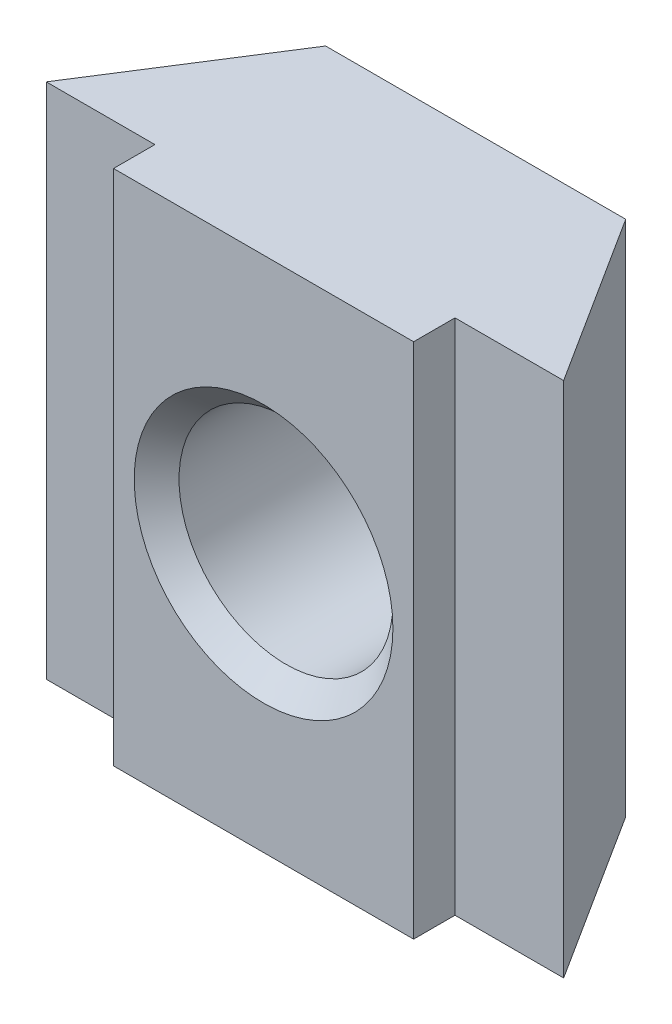
ISO-10303-21;
HEADER;
FILE_DESCRIPTION(('STEP AP214'),'2;1');
FILE_NAME('part.step','',(''),(''),'','','');
FILE_SCHEMA(('AUTOMOTIVE_DESIGN { 1 0 10303 214 1 1 1 1 }'));
ENDSEC;
DATA;
#1=APPLICATION_CONTEXT('core data for automotive mechanical design processes');
#2=APPLICATION_PROTOCOL_DEFINITION('international standard','automotive_design',2000,#1);
#3=PRODUCT_CONTEXT('',#1,'mechanical');
#4=PRODUCT('Part','Part','',(#3));
#5=PRODUCT_RELATED_PRODUCT_CATEGORY('part','',(#4));
#6=PRODUCT_DEFINITION_FORMATION('','',#4);
#7=PRODUCT_DEFINITION_CONTEXT('part definition',#1,'design');
#8=PRODUCT_DEFINITION('design','',#6,#7);
#9=PRODUCT_DEFINITION_SHAPE('','',#8);
#10=(LENGTH_UNIT() NAMED_UNIT(*) SI_UNIT(.MILLI.,.METRE.));
#11=(NAMED_UNIT(*) PLANE_ANGLE_UNIT() SI_UNIT($,.RADIAN.));
#12=(NAMED_UNIT(*) SI_UNIT($,.STERADIAN.) SOLID_ANGLE_UNIT());
#13=UNCERTAINTY_MEASURE_WITH_UNIT(LENGTH_MEASURE(1.E-05),#10,'distance_accuracy_value','');
#14=(GEOMETRIC_REPRESENTATION_CONTEXT(3) GLOBAL_UNCERTAINTY_ASSIGNED_CONTEXT((#13)) GLOBAL_UNIT_ASSIGNED_CONTEXT((#10,
#11,#12)) REPRESENTATION_CONTEXT('',''));
#15=CARTESIAN_POINT('',(0.,0.,0.));
#16=DIRECTION('',(0.,0.,1.));
#17=DIRECTION('',(1.,0.,0.));
#18=AXIS2_PLACEMENT_3D('',#15,#16,#17);
#19=CARTESIAN_POINT('',(-13.,-21.5,-9.30000000010978));
#20=DIRECTION('',(0.,0.,1.));
#21=DIRECTION('',(1.,0.,0.));
#22=AXIS2_PLACEMENT_3D('',#19,#20,#21);
#23=CONICAL_SURFACE('',#22,2.49999999991769,0.785398163397448);
#24=CARTESIAN_POINT('',(-13.,-21.5,-9.30000000005293));
#25=DIRECTION('',(0.,0.,1.));
#26=DIRECTION('',(1.,0.,0.));
#27=AXIS2_PLACEMENT_3D('',#24,#25,#26);
#28=CIRCLE('',#27,2.49999999997453);
#29=CARTESIAN_POINT('',(-10.5000000000255,-21.5,-9.30000000005293));
#30=VERTEX_POINT('',#29);
#31=EDGE_CURVE('E20',#30,#30,#28,.F.);
#32=ORIENTED_EDGE('',*,*,#31,.F.);
#33=EDGE_LOOP('',(#32));
#34=FACE_BOUND('',#33,.T.);
#35=CARTESIAN_POINT('',(-13.,-21.5,-9.733));
#36=DIRECTION('',(0.,0.,1.));
#37=DIRECTION('',(1.,0.,0.));
#38=AXIS2_PLACEMENT_3D('',#35,#36,#37);
#39=CIRCLE('',#38,2.067);
#40=CARTESIAN_POINT('',(-10.933,-21.5,-9.733));
#41=VERTEX_POINT('',#40);
#42=EDGE_CURVE('E122',#41,#41,#39,.F.);
#43=ORIENTED_EDGE('',*,*,#42,.T.);
#44=EDGE_LOOP('',(#43));
#45=FACE_BOUND('',#44,.T.);
#46=ADVANCED_FACE('F17',(#34,#45),#23,.F.);
#47=CARTESIAN_POINT('',(-15.9,-26.5,-9.3));
#48=DIRECTION('',(-1.,0.,0.));
#49=DIRECTION('',(0.,0.,1.));
#50=AXIS2_PLACEMENT_3D('',#47,#48,#49);
#51=PLANE('',#50);
#52=DIRECTION('',(0.,0.,1.));
#53=VECTOR('',#52,1.);
#54=CARTESIAN_POINT('',(-15.9,-26.5,-9.3));
#55=LINE('',#54,#53);
#56=CARTESIAN_POINT('',(-15.9,-26.5,-10.1));
#57=VERTEX_POINT('',#56);
#58=CARTESIAN_POINT('',(-15.9,-26.5,-9.3));
#59=VERTEX_POINT('',#58);
#60=EDGE_CURVE('E125',#57,#59,#55,.T.);
#61=ORIENTED_EDGE('',*,*,#60,.T.);
#62=DIRECTION('',(0.,1.,0.));
#63=VECTOR('',#62,1.);
#64=CARTESIAN_POINT('',(-15.9,-26.5,-9.3));
#65=LINE('',#64,#63);
#66=CARTESIAN_POINT('',(-15.9,-16.5,-9.3));
#67=VERTEX_POINT('',#66);
#68=EDGE_CURVE('E104',#67,#59,#65,.F.);
#69=ORIENTED_EDGE('',*,*,#68,.F.);
#70=DIRECTION('',(0.,0.,1.));
#71=VECTOR('',#70,1.);
#72=CARTESIAN_POINT('',(-15.9,-16.5,-9.3));
#73=LINE('',#72,#71);
#74=CARTESIAN_POINT('',(-15.9,-16.5,-10.1));
#75=VERTEX_POINT('',#74);
#76=EDGE_CURVE('E79',#67,#75,#73,.F.);
#77=ORIENTED_EDGE('',*,*,#76,.T.);
#78=DIRECTION('',(0.,1.,0.));
#79=VECTOR('',#78,1.);
#80=CARTESIAN_POINT('',(-15.9,-26.5,-10.1));
#81=LINE('',#80,#79);
#82=EDGE_CURVE('E103',#57,#75,#81,.T.);
#83=ORIENTED_EDGE('',*,*,#82,.F.);
#84=EDGE_LOOP('',(#61,#69,#77,#83));
#85=FACE_BOUND('',#84,.T.);
#86=ADVANCED_FACE('F263',(#85),#51,.T.);
#87=CARTESIAN_POINT('',(-13.,-21.5,-11.35));
#88=DIRECTION('',(0.,0.,1.));
#89=DIRECTION('',(1.,0.,0.));
#90=AXIS2_PLACEMENT_3D('',#87,#88,#89);
#91=CYLINDRICAL_SURFACE('',#90,2.067);
#92=CARTESIAN_POINT('',(-13.,-21.5,-12.9670000000033));
#93=DIRECTION('',(0.,0.,-1.));
#94=DIRECTION('',(-1.,0.,0.));
#95=AXIS2_PLACEMENT_3D('',#92,#93,#94);
#96=CIRCLE('',#95,2.06699999998773);
#97=CARTESIAN_POINT('',(-15.0669999999877,-21.5,-12.9670000000033));
#98=VERTEX_POINT('',#97);
#99=EDGE_CURVE('E116',#98,#98,#96,.T.);
#100=ORIENTED_EDGE('',*,*,#99,.T.);
#101=EDGE_LOOP('',(#100));
#102=FACE_BOUND('',#101,.T.);
#103=ORIENTED_EDGE('',*,*,#42,.F.);
#104=EDGE_LOOP('',(#103));
#105=FACE_BOUND('',#104,.T.);
#106=ADVANCED_FACE('F254',(#102,#105),#91,.F.);
#107=CARTESIAN_POINT('',(-10.1,-26.5,-10.1));
#108=DIRECTION('',(1.,0.,0.));
#109=DIRECTION('',(0.,0.,-1.));
#110=AXIS2_PLACEMENT_3D('',#107,#108,#109);
#111=PLANE('',#110);
#112=DIRECTION('',(0.,0.,-1.));
#113=VECTOR('',#112,1.);
#114=CARTESIAN_POINT('',(-10.1,-26.5,-10.1));
#115=LINE('',#114,#113);
#116=CARTESIAN_POINT('',(-10.1,-26.5,-9.3));
#117=VERTEX_POINT('',#116);
#118=CARTESIAN_POINT('',(-10.1,-26.5,-10.1));
#119=VERTEX_POINT('',#118);
#120=EDGE_CURVE('E120',#117,#119,#115,.T.);
#121=ORIENTED_EDGE('',*,*,#120,.T.);
#122=DIRECTION('',(0.,1.,0.));
#123=VECTOR('',#122,1.);
#124=CARTESIAN_POINT('',(-10.1,-26.5,-10.1));
#125=LINE('',#124,#123);
#126=CARTESIAN_POINT('',(-10.1,-16.5,-10.1));
#127=VERTEX_POINT('',#126);
#128=EDGE_CURVE('E91',#127,#119,#125,.F.);
#129=ORIENTED_EDGE('',*,*,#128,.F.);
#130=DIRECTION('',(0.,0.,-1.));
#131=VECTOR('',#130,1.);
#132=CARTESIAN_POINT('',(-10.1,-16.5,-9.3));
#133=LINE('',#132,#131);
#134=CARTESIAN_POINT('',(-10.1,-16.5,-9.3));
#135=VERTEX_POINT('',#134);
#136=EDGE_CURVE('E85',#127,#135,#133,.F.);
#137=ORIENTED_EDGE('',*,*,#136,.T.);
#138=DIRECTION('',(0.,1.,0.));
#139=VECTOR('',#138,1.);
#140=CARTESIAN_POINT('',(-10.1,-26.5,-9.3));
#141=LINE('',#140,#139);
#142=EDGE_CURVE('E88',#117,#135,#141,.T.);
#143=ORIENTED_EDGE('',*,*,#142,.F.);
#144=EDGE_LOOP('',(#121,#129,#137,#143));
#145=FACE_BOUND('',#144,.T.);
#146=ADVANCED_FACE('F87',(#145),#111,.T.);
#147=CARTESIAN_POINT('',(-10.1,-26.5,-9.3));
#148=DIRECTION('',(0.,0.,1.));
#149=DIRECTION('',(1.,0.,0.));
#150=AXIS2_PLACEMENT_3D('',#147,#148,#149);
#151=PLANE('',#150);
#152=DIRECTION('',(1.,0.,0.));
#153=VECTOR('',#152,1.);
#154=CARTESIAN_POINT('',(-13.,-26.5,-9.3));
#155=LINE('',#154,#153);
#156=EDGE_CURVE('E102',#117,#59,#155,.F.);
#157=ORIENTED_EDGE('',*,*,#156,.F.);
#158=ORIENTED_EDGE('',*,*,#142,.T.);
#159=DIRECTION('',(1.,0.,0.));
#160=VECTOR('',#159,1.);
#161=CARTESIAN_POINT('',(-13.,-16.5,-9.3));
#162=LINE('',#161,#160);
#163=EDGE_CURVE('E93',#135,#67,#162,.F.);
#164=ORIENTED_EDGE('',*,*,#163,.T.);
#165=ORIENTED_EDGE('',*,*,#68,.T.);
#166=EDGE_LOOP('',(#157,#158,#164,#165));
#167=FACE_BOUND('',#166,.T.);
#168=ORIENTED_EDGE('',*,*,#31,.T.);
#169=EDGE_LOOP('',(#168));
#170=FACE_BOUND('',#169,.T.);
#171=ADVANCED_FACE('F98',(#167,#170),#151,.T.);
#172=CARTESIAN_POINT('',(-15.9,-26.5,-10.1));
#173=DIRECTION('',(0.,0.,1.));
#174=DIRECTION('',(1.,0.,0.));
#175=AXIS2_PLACEMENT_3D('',#172,#173,#174);
#176=PLANE('',#175);
#177=DIRECTION('',(1.,0.,0.));
#178=VECTOR('',#177,1.);
#179=CARTESIAN_POINT('',(-13.,-26.5,-10.1));
#180=LINE('',#179,#178);
#181=CARTESIAN_POINT('',(-18.,-26.5,-10.1));
#182=VERTEX_POINT('',#181);
#183=EDGE_CURVE('E137',#57,#182,#180,.F.);
#184=ORIENTED_EDGE('',*,*,#183,.F.);
#185=ORIENTED_EDGE('',*,*,#82,.T.);
#186=DIRECTION('',(1.,0.,0.));
#187=VECTOR('',#186,1.);
#188=CARTESIAN_POINT('',(-13.,-16.5,-10.1));
#189=LINE('',#188,#187);
#190=CARTESIAN_POINT('',(-18.,-16.5,-10.1));
#191=VERTEX_POINT('',#190);
#192=EDGE_CURVE('E108',#75,#191,#189,.F.);
#193=ORIENTED_EDGE('',*,*,#192,.T.);
#194=DIRECTION('',(0.,1.,0.));
#195=VECTOR('',#194,1.);
#196=CARTESIAN_POINT('',(-18.,-26.5,-10.1));
#197=LINE('',#196,#195);
#198=EDGE_CURVE('E94',#182,#191,#197,.T.);
#199=ORIENTED_EDGE('',*,*,#198,.F.);
#200=EDGE_LOOP('',(#184,#185,#193,#199));
#201=FACE_BOUND('',#200,.T.);
#202=ADVANCED_FACE('F227',(#201),#176,.T.);
#203=CARTESIAN_POINT('',(-13.,-21.5,-13.3999999999332));
#204=DIRECTION('',(0.,0.,-1.));
#205=DIRECTION('',(-1.,0.,0.));
#206=AXIS2_PLACEMENT_3D('',#203,#204,#205);
#207=CONICAL_SURFACE('',#206,2.49999999991769,0.785398163397448);
#208=CARTESIAN_POINT('',(-13.,-21.5,-13.3999999999901));
#209=DIRECTION('',(0.,0.,-1.));
#210=DIRECTION('',(-1.,0.,0.));
#211=AXIS2_PLACEMENT_3D('',#208,#209,#210);
#212=CIRCLE('',#211,2.49999999997453);
#213=CARTESIAN_POINT('',(-15.4999999999745,-21.5,-13.3999999999901));
#214=VERTEX_POINT('',#213);
#215=EDGE_CURVE('E129',#214,#214,#212,.F.);
#216=ORIENTED_EDGE('',*,*,#215,.F.);
#217=EDGE_LOOP('',(#216));
#218=FACE_BOUND('',#217,.T.);
#219=ORIENTED_EDGE('',*,*,#99,.F.);
#220=EDGE_LOOP('',(#219));
#221=FACE_BOUND('',#220,.T.);
#222=ADVANCED_FACE('F218',(#218,#221),#207,.F.);
#223=CARTESIAN_POINT('',(-18.,-26.5,-10.1));
#224=DIRECTION('',(-0.843661487732107,0.,-0.536875492193159));
#225=DIRECTION('',(-0.536875492193159,0.,0.843661487732107));
#226=AXIS2_PLACEMENT_3D('',#223,#224,#225);
#227=PLANE('',#226);
#228=DIRECTION('',(0.536875492193159,0.,-0.843661487732107));
#229=VECTOR('',#228,1.);
#230=CARTESIAN_POINT('',(-18.,-26.5,-10.1));
#231=LINE('',#230,#229);
#232=CARTESIAN_POINT('',(-15.9,-26.5,-13.4));
#233=VERTEX_POINT('',#232);
#234=EDGE_CURVE('E132',#182,#233,#231,.T.);
#235=ORIENTED_EDGE('',*,*,#234,.F.);
#236=ORIENTED_EDGE('',*,*,#198,.T.);
#237=DIRECTION('',(0.536875492193159,0.,-0.843661487732107));
#238=VECTOR('',#237,1.);
#239=CARTESIAN_POINT('',(-18.,-16.5,-10.1));
#240=LINE('',#239,#238);
#241=CARTESIAN_POINT('',(-15.9,-16.5,-13.4));
#242=VERTEX_POINT('',#241);
#243=EDGE_CURVE('E110',#191,#242,#240,.T.);
#244=ORIENTED_EDGE('',*,*,#243,.T.);
#245=DIRECTION('',(0.,1.,0.));
#246=VECTOR('',#245,1.);
#247=CARTESIAN_POINT('',(-15.9,-26.5,-13.4));
#248=LINE('',#247,#246);
#249=EDGE_CURVE('E155',#233,#242,#248,.T.);
#250=ORIENTED_EDGE('',*,*,#249,.F.);
#251=EDGE_LOOP('',(#235,#236,#244,#250));
#252=FACE_BOUND('',#251,.T.);
#253=ADVANCED_FACE('F153',(#252),#227,.T.);
#254=CARTESIAN_POINT('',(-13.,-16.5,-9.3));
#255=DIRECTION('',(0.,-1.,0.));
#256=DIRECTION('',(0.,0.,-1.));
#257=AXIS2_PLACEMENT_3D('',#254,#255,#256);
#258=PLANE('',#257);
#259=DIRECTION('',(-1.,0.,0.));
#260=VECTOR('',#259,1.);
#261=CARTESIAN_POINT('',(-15.9,-16.5,-13.4));
#262=LINE('',#261,#260);
#263=CARTESIAN_POINT('',(-10.1,-16.5,-13.4));
#264=VERTEX_POINT('',#263);
#265=EDGE_CURVE('E131',#242,#264,#262,.F.);
#266=ORIENTED_EDGE('',*,*,#265,.F.);
#267=ORIENTED_EDGE('',*,*,#243,.F.);
#268=ORIENTED_EDGE('',*,*,#192,.F.);
#269=ORIENTED_EDGE('',*,*,#76,.F.);
#270=ORIENTED_EDGE('',*,*,#163,.F.);
#271=ORIENTED_EDGE('',*,*,#136,.F.);
#272=DIRECTION('',(1.,0.,0.));
#273=VECTOR('',#272,1.);
#274=CARTESIAN_POINT('',(-8.,-16.5,-10.1));
#275=LINE('',#274,#273);
#276=CARTESIAN_POINT('',(-8.,-16.5,-10.1));
#277=VERTEX_POINT('',#276);
#278=EDGE_CURVE('E150',#277,#127,#275,.F.);
#279=ORIENTED_EDGE('',*,*,#278,.F.);
#280=DIRECTION('',(-0.536875492193159,0.,-0.843661487732107));
#281=VECTOR('',#280,1.);
#282=CARTESIAN_POINT('',(-10.1,-16.5,-13.4));
#283=LINE('',#282,#281);
#284=EDGE_CURVE('E157',#264,#277,#283,.F.);
#285=ORIENTED_EDGE('',*,*,#284,.F.);
#286=EDGE_LOOP('',(#266,#267,#268,#269,#270,#271,#279,#285));
#287=FACE_BOUND('',#286,.T.);
#288=ADVANCED_FACE('F107',(#287),#258,.F.);
#289=CARTESIAN_POINT('',(-8.,-26.5,-10.1));
#290=DIRECTION('',(0.,0.,1.));
#291=DIRECTION('',(1.,0.,0.));
#292=AXIS2_PLACEMENT_3D('',#289,#290,#291);
#293=PLANE('',#292);
#294=DIRECTION('',(1.,0.,0.));
#295=VECTOR('',#294,1.);
#296=CARTESIAN_POINT('',(-13.,-26.5,-10.1));
#297=LINE('',#296,#295);
#298=CARTESIAN_POINT('',(-8.,-26.5,-10.1));
#299=VERTEX_POINT('',#298);
#300=EDGE_CURVE('E146',#299,#119,#297,.F.);
#301=ORIENTED_EDGE('',*,*,#300,.F.);
#302=DIRECTION('',(0.,1.,0.));
#303=VECTOR('',#302,1.);
#304=CARTESIAN_POINT('',(-8.,-26.5,-10.1));
#305=LINE('',#304,#303);
#306=EDGE_CURVE('E161',#277,#299,#305,.F.);
#307=ORIENTED_EDGE('',*,*,#306,.F.);
#308=ORIENTED_EDGE('',*,*,#278,.T.);
#309=ORIENTED_EDGE('',*,*,#128,.T.);
#310=EDGE_LOOP('',(#301,#307,#308,#309));
#311=FACE_BOUND('',#310,.T.);
#312=ADVANCED_FACE('F172',(#311),#293,.T.);
#313=CARTESIAN_POINT('',(-13.,-26.5,-9.3));
#314=DIRECTION('',(0.,-1.,0.));
#315=DIRECTION('',(0.,0.,-1.));
#316=AXIS2_PLACEMENT_3D('',#313,#314,#315);
#317=PLANE('',#316);
#318=ORIENTED_EDGE('',*,*,#183,.T.);
#319=ORIENTED_EDGE('',*,*,#234,.T.);
#320=DIRECTION('',(-1.,0.,0.));
#321=VECTOR('',#320,1.);
#322=CARTESIAN_POINT('',(-15.9,-26.5,-13.4));
#323=LINE('',#322,#321);
#324=CARTESIAN_POINT('',(-10.1,-26.5,-13.4));
#325=VERTEX_POINT('',#324);
#326=EDGE_CURVE('E35',#325,#233,#323,.T.);
#327=ORIENTED_EDGE('',*,*,#326,.F.);
#328=DIRECTION('',(-0.536875492193159,0.,-0.843661487732107));
#329=VECTOR('',#328,1.);
#330=CARTESIAN_POINT('',(-10.1,-26.5,-13.4));
#331=LINE('',#330,#329);
#332=EDGE_CURVE('E26',#299,#325,#331,.T.);
#333=ORIENTED_EDGE('',*,*,#332,.F.);
#334=ORIENTED_EDGE('',*,*,#300,.T.);
#335=ORIENTED_EDGE('',*,*,#120,.F.);
#336=ORIENTED_EDGE('',*,*,#156,.T.);
#337=ORIENTED_EDGE('',*,*,#60,.F.);
#338=EDGE_LOOP('',(#318,#319,#327,#333,#334,#335,#336,#337));
#339=FACE_BOUND('',#338,.T.);
#340=ADVANCED_FACE('F170',(#339),#317,.T.);
#341=CARTESIAN_POINT('',(-15.9,-26.5,-13.4));
#342=DIRECTION('',(0.,0.,-1.));
#343=DIRECTION('',(-1.,0.,0.));
#344=AXIS2_PLACEMENT_3D('',#341,#342,#343);
#345=PLANE('',#344);
#346=ORIENTED_EDGE('',*,*,#326,.T.);
#347=ORIENTED_EDGE('',*,*,#249,.T.);
#348=ORIENTED_EDGE('',*,*,#265,.T.);
#349=DIRECTION('',(0.,1.,0.));
#350=VECTOR('',#349,1.);
#351=CARTESIAN_POINT('',(-10.1,-26.5,-13.4));
#352=LINE('',#351,#350);
#353=EDGE_CURVE('E11',#325,#264,#352,.T.);
#354=ORIENTED_EDGE('',*,*,#353,.F.);
#355=EDGE_LOOP('',(#346,#347,#348,#354));
#356=FACE_BOUND('',#355,.T.);
#357=ORIENTED_EDGE('',*,*,#215,.T.);
#358=EDGE_LOOP('',(#357));
#359=FACE_BOUND('',#358,.T.);
#360=ADVANCED_FACE('F159',(#356,#359),#345,.T.);
#361=CARTESIAN_POINT('',(-10.1,-26.5,-13.4));
#362=DIRECTION('',(0.843661487732107,0.,-0.536875492193159));
#363=DIRECTION('',(-0.536875492193159,0.,-0.843661487732107));
#364=AXIS2_PLACEMENT_3D('',#361,#362,#363);
#365=PLANE('',#364);
#366=ORIENTED_EDGE('',*,*,#332,.T.);
#367=ORIENTED_EDGE('',*,*,#353,.T.);
#368=ORIENTED_EDGE('',*,*,#284,.T.);
#369=ORIENTED_EDGE('',*,*,#306,.T.);
#370=EDGE_LOOP('',(#366,#367,#368,#369));
#371=FACE_BOUND('',#370,.T.);
#372=ADVANCED_FACE('F168',(#371),#365,.T.);
#373=CLOSED_SHELL('',(#46,#86,#106,#146,#171,#202,#222,#253,#288,#312,#340,#360,#372));
#374=MANIFOLD_SOLID_BREP('B1',#373);
#375=ADVANCED_BREP_SHAPE_REPRESENTATION('',(#18,#374),#14);
#376=SHAPE_DEFINITION_REPRESENTATION(#9,#375);
ENDSEC;
END-ISO-10303-21;
